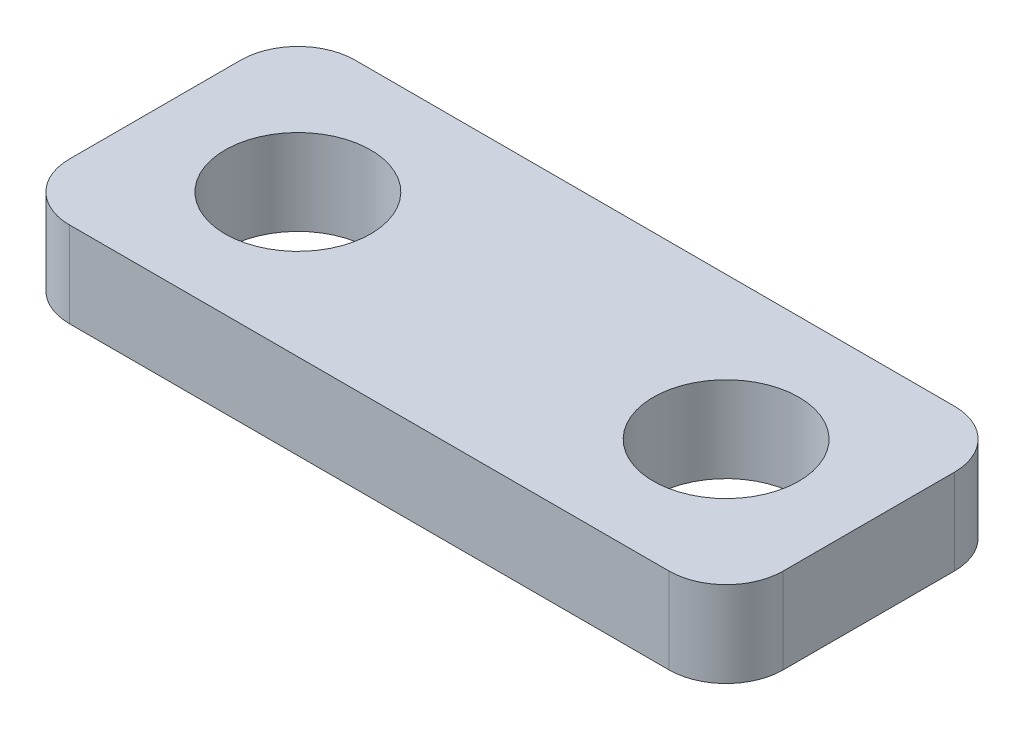
ISO-10303-21;
HEADER;
FILE_DESCRIPTION(('STEP AP214'),'2;1');
FILE_NAME('part.step','',(''),(''),'','','');
FILE_SCHEMA(('AUTOMOTIVE_DESIGN { 1 0 10303 214 1 1 1 1 }'));
ENDSEC;
DATA;
#1=APPLICATION_CONTEXT('core data for automotive mechanical design processes');
#2=APPLICATION_PROTOCOL_DEFINITION('international standard','automotive_design',2000,#1);
#3=PRODUCT_CONTEXT('',#1,'mechanical');
#4=PRODUCT('Part','Part','',(#3));
#5=PRODUCT_RELATED_PRODUCT_CATEGORY('part','',(#4));
#6=PRODUCT_DEFINITION_FORMATION('','',#4);
#7=PRODUCT_DEFINITION_CONTEXT('part definition',#1,'design');
#8=PRODUCT_DEFINITION('design','',#6,#7);
#9=PRODUCT_DEFINITION_SHAPE('','',#8);
#10=(LENGTH_UNIT() NAMED_UNIT(*) SI_UNIT(.MILLI.,.METRE.));
#11=(NAMED_UNIT(*) PLANE_ANGLE_UNIT() SI_UNIT($,.RADIAN.));
#12=(NAMED_UNIT(*) SI_UNIT($,.STERADIAN.) SOLID_ANGLE_UNIT());
#13=UNCERTAINTY_MEASURE_WITH_UNIT(LENGTH_MEASURE(1.E-05),#10,'distance_accuracy_value','');
#14=(GEOMETRIC_REPRESENTATION_CONTEXT(3) GLOBAL_UNCERTAINTY_ASSIGNED_CONTEXT((#13)) GLOBAL_UNIT_ASSIGNED_CONTEXT((#10,
#11,#12)) REPRESENTATION_CONTEXT('',''));
#15=CARTESIAN_POINT('',(0.,0.,0.));
#16=DIRECTION('',(0.,0.,1.));
#17=DIRECTION('',(1.,0.,0.));
#18=AXIS2_PLACEMENT_3D('',#15,#16,#17);
#19=CARTESIAN_POINT('',(0.,3.,0.));
#20=DIRECTION('',(0.,-1.,0.));
#21=DIRECTION('',(0.,0.,-1.));
#22=AXIS2_PLACEMENT_3D('',#19,#20,#21);
#23=PLANE('',#22);
#24=DIRECTION('',(-1.,0.,0.));
#25=VECTOR('',#24,1.);
#26=CARTESIAN_POINT('',(-12.5,3.,-5.));
#27=LINE('',#26,#25);
#28=CARTESIAN_POINT('',(10.5,3.,-5.));
#29=VERTEX_POINT('',#28);
#30=CARTESIAN_POINT('',(-10.5,3.,-5.));
#31=VERTEX_POINT('',#30);
#32=EDGE_CURVE('E200',#29,#31,#27,.T.);
#33=ORIENTED_EDGE('',*,*,#32,.T.);
#34=CARTESIAN_POINT('',(-10.5,3.,-3.));
#35=DIRECTION('',(0.,-1.,0.));
#36=DIRECTION('',(0.,0.,-1.));
#37=AXIS2_PLACEMENT_3D('',#34,#35,#36);
#38=CIRCLE('',#37,2.);
#39=CARTESIAN_POINT('',(-12.5,3.,-3.));
#40=VERTEX_POINT('',#39);
#41=EDGE_CURVE('E173',#31,#40,#38,.F.);
#42=ORIENTED_EDGE('',*,*,#41,.T.);
#43=DIRECTION('',(0.,0.,1.));
#44=VECTOR('',#43,1.);
#45=CARTESIAN_POINT('',(-12.5,3.,5.));
#46=LINE('',#45,#44);
#47=CARTESIAN_POINT('',(-12.5,3.,3.));
#48=VERTEX_POINT('',#47);
#49=EDGE_CURVE('E130',#40,#48,#46,.T.);
#50=ORIENTED_EDGE('',*,*,#49,.T.);
#51=CARTESIAN_POINT('',(-10.5,3.,3.));
#52=DIRECTION('',(0.,-1.,0.));
#53=DIRECTION('',(0.,0.,-1.));
#54=AXIS2_PLACEMENT_3D('',#51,#52,#53);
#55=CIRCLE('',#54,2.);
#56=CARTESIAN_POINT('',(-10.5,3.,5.));
#57=VERTEX_POINT('',#56);
#58=EDGE_CURVE('E65',#48,#57,#55,.F.);
#59=ORIENTED_EDGE('',*,*,#58,.T.);
#60=DIRECTION('',(1.,0.,0.));
#61=VECTOR('',#60,1.);
#62=CARTESIAN_POINT('',(-12.5,3.,5.));
#63=LINE('',#62,#61);
#64=CARTESIAN_POINT('',(10.5,3.,5.));
#65=VERTEX_POINT('',#64);
#66=EDGE_CURVE('E151',#57,#65,#63,.T.);
#67=ORIENTED_EDGE('',*,*,#66,.T.);
#68=CARTESIAN_POINT('',(10.5,3.,3.));
#69=DIRECTION('',(0.,-1.,0.));
#70=DIRECTION('',(0.,0.,-1.));
#71=AXIS2_PLACEMENT_3D('',#68,#69,#70);
#72=CIRCLE('',#71,2.);
#73=CARTESIAN_POINT('',(12.5,3.,3.));
#74=VERTEX_POINT('',#73);
#75=EDGE_CURVE('E167',#65,#74,#72,.F.);
#76=ORIENTED_EDGE('',*,*,#75,.T.);
#77=DIRECTION('',(0.,0.,-1.));
#78=VECTOR('',#77,1.);
#79=CARTESIAN_POINT('',(12.5,3.,5.));
#80=LINE('',#79,#78);
#81=CARTESIAN_POINT('',(12.5,3.,-3.));
#82=VERTEX_POINT('',#81);
#83=EDGE_CURVE('E144',#74,#82,#80,.T.);
#84=ORIENTED_EDGE('',*,*,#83,.T.);
#85=CARTESIAN_POINT('',(10.5,3.,-3.));
#86=DIRECTION('',(0.,-1.,0.));
#87=DIRECTION('',(0.,0.,-1.));
#88=AXIS2_PLACEMENT_3D('',#85,#86,#87);
#89=CIRCLE('',#88,2.);
#90=EDGE_CURVE('E170',#82,#29,#89,.F.);
#91=ORIENTED_EDGE('',*,*,#90,.T.);
#92=EDGE_LOOP('',(#33,#42,#50,#59,#67,#76,#84,#91));
#93=FACE_BOUND('',#92,.T.);
#94=CARTESIAN_POINT('',(-7.5,3.,0.));
#95=DIRECTION('',(0.,1.,0.));
#96=DIRECTION('',(0.,0.,1.));
#97=AXIS2_PLACEMENT_3D('',#94,#95,#96);
#98=CIRCLE('',#97,2.55);
#99=CARTESIAN_POINT('',(-7.5,3.,2.55));
#100=VERTEX_POINT('',#99);
#101=EDGE_CURVE('E213',#100,#100,#98,.T.);
#102=ORIENTED_EDGE('',*,*,#101,.F.);
#103=EDGE_LOOP('',(#102));
#104=FACE_BOUND('',#103,.T.);
#105=CARTESIAN_POINT('',(7.5,3.,0.));
#106=DIRECTION('',(0.,1.,0.));
#107=DIRECTION('',(0.,0.,-1.));
#108=AXIS2_PLACEMENT_3D('',#105,#106,#107);
#109=CIRCLE('',#108,2.55);
#110=CARTESIAN_POINT('',(7.5,3.,-2.55));
#111=VERTEX_POINT('',#110);
#112=EDGE_CURVE('E220',#111,#111,#109,.T.);
#113=ORIENTED_EDGE('',*,*,#112,.F.);
#114=EDGE_LOOP('',(#113));
#115=FACE_BOUND('',#114,.T.);
#116=ADVANCED_FACE('F44',(#93,#104,#115),#23,.F.);
#117=CARTESIAN_POINT('',(0.,0.,0.));
#118=DIRECTION('',(0.,-1.,0.));
#119=DIRECTION('',(0.,0.,-1.));
#120=AXIS2_PLACEMENT_3D('',#117,#118,#119);
#121=PLANE('',#120);
#122=CARTESIAN_POINT('',(-7.5,0.,0.));
#123=DIRECTION('',(0.,1.,0.));
#124=DIRECTION('',(0.,0.,1.));
#125=AXIS2_PLACEMENT_3D('',#122,#123,#124);
#126=CIRCLE('',#125,2.55);
#127=CARTESIAN_POINT('',(-7.5,0.,2.55));
#128=VERTEX_POINT('',#127);
#129=EDGE_CURVE('E206',#128,#128,#126,.T.);
#130=ORIENTED_EDGE('',*,*,#129,.T.);
#131=EDGE_LOOP('',(#130));
#132=FACE_BOUND('',#131,.T.);
#133=DIRECTION('',(0.,0.,1.));
#134=VECTOR('',#133,1.);
#135=CARTESIAN_POINT('',(-12.5,0.,5.));
#136=LINE('',#135,#134);
#137=CARTESIAN_POINT('',(-12.5,0.,-3.));
#138=VERTEX_POINT('',#137);
#139=CARTESIAN_POINT('',(-12.5,0.,3.));
#140=VERTEX_POINT('',#139);
#141=EDGE_CURVE('E128',#138,#140,#136,.T.);
#142=ORIENTED_EDGE('',*,*,#141,.F.);
#143=CARTESIAN_POINT('',(-10.5,0.,-3.));
#144=DIRECTION('',(0.,-1.,0.));
#145=DIRECTION('',(0.,0.,-1.));
#146=AXIS2_PLACEMENT_3D('',#143,#144,#145);
#147=CIRCLE('',#146,2.);
#148=CARTESIAN_POINT('',(-10.5,0.,-5.));
#149=VERTEX_POINT('',#148);
#150=EDGE_CURVE('E110',#138,#149,#147,.T.);
#151=ORIENTED_EDGE('',*,*,#150,.T.);
#152=DIRECTION('',(-1.,0.,0.));
#153=VECTOR('',#152,1.);
#154=CARTESIAN_POINT('',(-12.5,0.,-5.));
#155=LINE('',#154,#153);
#156=CARTESIAN_POINT('',(10.5,0.,-5.));
#157=VERTEX_POINT('',#156);
#158=EDGE_CURVE('E140',#157,#149,#155,.T.);
#159=ORIENTED_EDGE('',*,*,#158,.F.);
#160=CARTESIAN_POINT('',(10.5,0.,-3.));
#161=DIRECTION('',(0.,-1.,0.));
#162=DIRECTION('',(0.,0.,-1.));
#163=AXIS2_PLACEMENT_3D('',#160,#161,#162);
#164=CIRCLE('',#163,2.);
#165=CARTESIAN_POINT('',(12.5,0.,-3.));
#166=VERTEX_POINT('',#165);
#167=EDGE_CURVE('E122',#157,#166,#164,.T.);
#168=ORIENTED_EDGE('',*,*,#167,.T.);
#169=DIRECTION('',(0.,0.,-1.));
#170=VECTOR('',#169,1.);
#171=CARTESIAN_POINT('',(12.5,0.,5.));
#172=LINE('',#171,#170);
#173=CARTESIAN_POINT('',(12.5,0.,3.));
#174=VERTEX_POINT('',#173);
#175=EDGE_CURVE('E146',#174,#166,#172,.T.);
#176=ORIENTED_EDGE('',*,*,#175,.F.);
#177=CARTESIAN_POINT('',(10.5,0.,3.));
#178=DIRECTION('',(0.,-1.,0.));
#179=DIRECTION('',(0.,0.,-1.));
#180=AXIS2_PLACEMENT_3D('',#177,#178,#179);
#181=CIRCLE('',#180,2.);
#182=CARTESIAN_POINT('',(10.5,0.,5.));
#183=VERTEX_POINT('',#182);
#184=EDGE_CURVE('E155',#174,#183,#181,.T.);
#185=ORIENTED_EDGE('',*,*,#184,.T.);
#186=DIRECTION('',(1.,0.,0.));
#187=VECTOR('',#186,1.);
#188=CARTESIAN_POINT('',(-12.5,0.,5.));
#189=LINE('',#188,#187);
#190=CARTESIAN_POINT('',(-10.5,0.,5.));
#191=VERTEX_POINT('',#190);
#192=EDGE_CURVE('E139',#191,#183,#189,.T.);
#193=ORIENTED_EDGE('',*,*,#192,.F.);
#194=CARTESIAN_POINT('',(-10.5,0.,3.));
#195=DIRECTION('',(0.,-1.,0.));
#196=DIRECTION('',(0.,0.,-1.));
#197=AXIS2_PLACEMENT_3D('',#194,#195,#196);
#198=CIRCLE('',#197,2.);
#199=EDGE_CURVE('E132',#191,#140,#198,.T.);
#200=ORIENTED_EDGE('',*,*,#199,.T.);
#201=EDGE_LOOP('',(#142,#151,#159,#168,#176,#185,#193,#200));
#202=FACE_BOUND('',#201,.T.);
#203=CARTESIAN_POINT('',(7.5,0.,0.));
#204=DIRECTION('',(0.,1.,0.));
#205=DIRECTION('',(0.,0.,-1.));
#206=AXIS2_PLACEMENT_3D('',#203,#204,#205);
#207=CIRCLE('',#206,2.55);
#208=CARTESIAN_POINT('',(7.5,0.,-2.55));
#209=VERTEX_POINT('',#208);
#210=EDGE_CURVE('E222',#209,#209,#207,.T.);
#211=ORIENTED_EDGE('',*,*,#210,.T.);
#212=EDGE_LOOP('',(#211));
#213=FACE_BOUND('',#212,.T.);
#214=ADVANCED_FACE('F135',(#132,#202,#213),#121,.T.);
#215=CARTESIAN_POINT('',(12.5,3.,5.));
#216=DIRECTION('',(-1.,0.,0.));
#217=DIRECTION('',(0.,0.,1.));
#218=AXIS2_PLACEMENT_3D('',#215,#216,#217);
#219=PLANE('',#218);
#220=ORIENTED_EDGE('',*,*,#175,.T.);
#221=DIRECTION('',(0.,-1.,0.));
#222=VECTOR('',#221,1.);
#223=CARTESIAN_POINT('',(12.5,3.,-3.));
#224=LINE('',#223,#222);
#225=EDGE_CURVE('E180',#166,#82,#224,.F.);
#226=ORIENTED_EDGE('',*,*,#225,.T.);
#227=ORIENTED_EDGE('',*,*,#83,.F.);
#228=DIRECTION('',(0.,-1.,0.));
#229=VECTOR('',#228,1.);
#230=CARTESIAN_POINT('',(12.5,3.,3.));
#231=LINE('',#230,#229);
#232=EDGE_CURVE('E176',#74,#174,#231,.T.);
#233=ORIENTED_EDGE('',*,*,#232,.T.);
#234=EDGE_LOOP('',(#220,#226,#227,#233));
#235=FACE_BOUND('',#234,.T.);
#236=ADVANCED_FACE('F195',(#235),#219,.F.);
#237=CARTESIAN_POINT('',(-12.5,3.,-5.));
#238=DIRECTION('',(0.,0.,1.));
#239=DIRECTION('',(1.,0.,0.));
#240=AXIS2_PLACEMENT_3D('',#237,#238,#239);
#241=PLANE('',#240);
#242=ORIENTED_EDGE('',*,*,#158,.T.);
#243=DIRECTION('',(0.,-1.,0.));
#244=VECTOR('',#243,1.);
#245=CARTESIAN_POINT('',(-10.5,3.,-5.));
#246=LINE('',#245,#244);
#247=EDGE_CURVE('E115',#149,#31,#246,.F.);
#248=ORIENTED_EDGE('',*,*,#247,.T.);
#249=ORIENTED_EDGE('',*,*,#32,.F.);
#250=DIRECTION('',(0.,-1.,0.));
#251=VECTOR('',#250,1.);
#252=CARTESIAN_POINT('',(10.5,3.,-5.));
#253=LINE('',#252,#251);
#254=EDGE_CURVE('E121',#29,#157,#253,.T.);
#255=ORIENTED_EDGE('',*,*,#254,.T.);
#256=EDGE_LOOP('',(#242,#248,#249,#255));
#257=FACE_BOUND('',#256,.T.);
#258=ADVANCED_FACE('F250',(#257),#241,.F.);
#259=CARTESIAN_POINT('',(-12.5,3.,5.));
#260=DIRECTION('',(1.,0.,0.));
#261=DIRECTION('',(0.,0.,-1.));
#262=AXIS2_PLACEMENT_3D('',#259,#260,#261);
#263=PLANE('',#262);
#264=ORIENTED_EDGE('',*,*,#49,.F.);
#265=DIRECTION('',(0.,-1.,0.));
#266=VECTOR('',#265,1.);
#267=CARTESIAN_POINT('',(-12.5,3.,-3.));
#268=LINE('',#267,#266);
#269=EDGE_CURVE('E114',#40,#138,#268,.T.);
#270=ORIENTED_EDGE('',*,*,#269,.T.);
#271=ORIENTED_EDGE('',*,*,#141,.T.);
#272=DIRECTION('',(0.,-1.,0.));
#273=VECTOR('',#272,1.);
#274=CARTESIAN_POINT('',(-12.5,3.,3.));
#275=LINE('',#274,#273);
#276=EDGE_CURVE('E133',#140,#48,#275,.F.);
#277=ORIENTED_EDGE('',*,*,#276,.T.);
#278=EDGE_LOOP('',(#264,#270,#271,#277));
#279=FACE_BOUND('',#278,.T.);
#280=ADVANCED_FACE('F127',(#279),#263,.F.);
#281=CARTESIAN_POINT('',(-12.5,3.,5.));
#282=DIRECTION('',(0.,0.,-1.));
#283=DIRECTION('',(-1.,0.,0.));
#284=AXIS2_PLACEMENT_3D('',#281,#282,#283);
#285=PLANE('',#284);
#286=ORIENTED_EDGE('',*,*,#192,.T.);
#287=DIRECTION('',(0.,-1.,0.));
#288=VECTOR('',#287,1.);
#289=CARTESIAN_POINT('',(10.5,3.,5.));
#290=LINE('',#289,#288);
#291=EDGE_CURVE('E11',#183,#65,#290,.F.);
#292=ORIENTED_EDGE('',*,*,#291,.T.);
#293=ORIENTED_EDGE('',*,*,#66,.F.);
#294=DIRECTION('',(0.,-1.,0.));
#295=VECTOR('',#294,1.);
#296=CARTESIAN_POINT('',(-10.5,3.,5.));
#297=LINE('',#296,#295);
#298=EDGE_CURVE('E53',#57,#191,#297,.T.);
#299=ORIENTED_EDGE('',*,*,#298,.T.);
#300=EDGE_LOOP('',(#286,#292,#293,#299));
#301=FACE_BOUND('',#300,.T.);
#302=ADVANCED_FACE('F185',(#301),#285,.F.);
#303=CARTESIAN_POINT('',(-7.5,3.,0.));
#304=DIRECTION('',(0.,-1.,0.));
#305=DIRECTION('',(0.,0.,-1.));
#306=AXIS2_PLACEMENT_3D('',#303,#304,#305);
#307=CYLINDRICAL_SURFACE('',#306,2.55);
#308=ORIENTED_EDGE('',*,*,#101,.T.);
#309=EDGE_LOOP('',(#308));
#310=FACE_BOUND('',#309,.T.);
#311=ORIENTED_EDGE('',*,*,#129,.F.);
#312=EDGE_LOOP('',(#311));
#313=FACE_BOUND('',#312,.T.);
#314=ADVANCED_FACE('F243',(#310,#313),#307,.F.);
#315=CARTESIAN_POINT('',(7.5,3.,0.));
#316=DIRECTION('',(0.,-1.,0.));
#317=DIRECTION('',(0.,0.,-1.));
#318=AXIS2_PLACEMENT_3D('',#315,#316,#317);
#319=CYLINDRICAL_SURFACE('',#318,2.55);
#320=ORIENTED_EDGE('',*,*,#112,.T.);
#321=EDGE_LOOP('',(#320));
#322=FACE_BOUND('',#321,.T.);
#323=ORIENTED_EDGE('',*,*,#210,.F.);
#324=EDGE_LOOP('',(#323));
#325=FACE_BOUND('',#324,.T.);
#326=ADVANCED_FACE('F230',(#322,#325),#319,.F.);
#327=CARTESIAN_POINT('',(-10.5,3.,-3.));
#328=DIRECTION('',(0.,-1.,0.));
#329=DIRECTION('',(0.,0.,-1.));
#330=AXIS2_PLACEMENT_3D('',#327,#328,#329);
#331=CYLINDRICAL_SURFACE('',#330,2.);
#332=ORIENTED_EDGE('',*,*,#41,.F.);
#333=ORIENTED_EDGE('',*,*,#247,.F.);
#334=ORIENTED_EDGE('',*,*,#150,.F.);
#335=ORIENTED_EDGE('',*,*,#269,.F.);
#336=EDGE_LOOP('',(#332,#333,#334,#335));
#337=FACE_BOUND('',#336,.T.);
#338=ADVANCED_FACE('F113',(#337),#331,.T.);
#339=CARTESIAN_POINT('',(10.5,3.,-3.));
#340=DIRECTION('',(0.,-1.,0.));
#341=DIRECTION('',(0.,0.,-1.));
#342=AXIS2_PLACEMENT_3D('',#339,#340,#341);
#343=CYLINDRICAL_SURFACE('',#342,2.);
#344=ORIENTED_EDGE('',*,*,#90,.F.);
#345=ORIENTED_EDGE('',*,*,#225,.F.);
#346=ORIENTED_EDGE('',*,*,#167,.F.);
#347=ORIENTED_EDGE('',*,*,#254,.F.);
#348=EDGE_LOOP('',(#344,#345,#346,#347));
#349=FACE_BOUND('',#348,.T.);
#350=ADVANCED_FACE('F258',(#349),#343,.T.);
#351=CARTESIAN_POINT('',(10.5,3.,3.));
#352=DIRECTION('',(0.,-1.,0.));
#353=DIRECTION('',(0.,0.,-1.));
#354=AXIS2_PLACEMENT_3D('',#351,#352,#353);
#355=CYLINDRICAL_SURFACE('',#354,2.);
#356=ORIENTED_EDGE('',*,*,#75,.F.);
#357=ORIENTED_EDGE('',*,*,#291,.F.);
#358=ORIENTED_EDGE('',*,*,#184,.F.);
#359=ORIENTED_EDGE('',*,*,#232,.F.);
#360=EDGE_LOOP('',(#356,#357,#358,#359));
#361=FACE_BOUND('',#360,.T.);
#362=ADVANCED_FACE('F192',(#361),#355,.T.);
#363=CARTESIAN_POINT('',(-10.5,3.,3.));
#364=DIRECTION('',(0.,-1.,0.));
#365=DIRECTION('',(0.,0.,-1.));
#366=AXIS2_PLACEMENT_3D('',#363,#364,#365);
#367=CYLINDRICAL_SURFACE('',#366,2.);
#368=ORIENTED_EDGE('',*,*,#58,.F.);
#369=ORIENTED_EDGE('',*,*,#276,.F.);
#370=ORIENTED_EDGE('',*,*,#199,.F.);
#371=ORIENTED_EDGE('',*,*,#298,.F.);
#372=EDGE_LOOP('',(#368,#369,#370,#371));
#373=FACE_BOUND('',#372,.T.);
#374=ADVANCED_FACE('F46',(#373),#367,.T.);
#375=CLOSED_SHELL('',(#116,#214,#236,#258,#280,#302,#314,#326,#338,#350,#362,#374));
#376=MANIFOLD_SOLID_BREP('B2',#375);
#377=ADVANCED_BREP_SHAPE_REPRESENTATION('',(#18,#376),#14);
#378=SHAPE_DEFINITION_REPRESENTATION(#9,#377);
ENDSEC;
END-ISO-10303-21;
